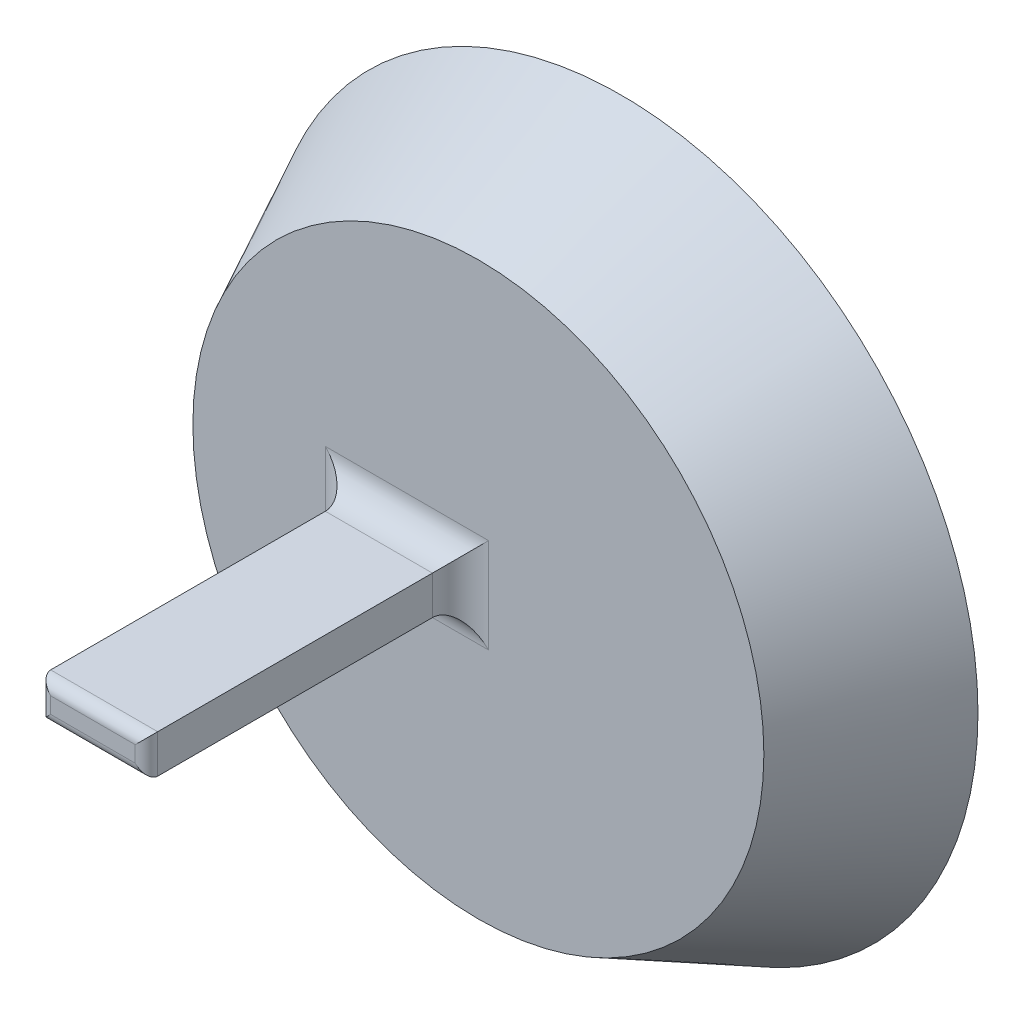
ISO-10303-21;
HEADER;
FILE_DESCRIPTION(('STEP AP214'),'2;1');
FILE_NAME('part.step','',(''),(''),'','','');
FILE_SCHEMA(('AUTOMOTIVE_DESIGN { 1 0 10303 214 1 1 1 1 }'));
ENDSEC;
DATA;
#1=APPLICATION_CONTEXT('core data for automotive mechanical design processes');
#2=APPLICATION_PROTOCOL_DEFINITION('international standard','automotive_design',2000,#1);
#3=PRODUCT_CONTEXT('',#1,'mechanical');
#4=PRODUCT('Part','Part','',(#3));
#5=PRODUCT_RELATED_PRODUCT_CATEGORY('part','',(#4));
#6=PRODUCT_DEFINITION_FORMATION('','',#4);
#7=PRODUCT_DEFINITION_CONTEXT('part definition',#1,'design');
#8=PRODUCT_DEFINITION('design','',#6,#7);
#9=PRODUCT_DEFINITION_SHAPE('','',#8);
#10=(LENGTH_UNIT() NAMED_UNIT(*) SI_UNIT(.MILLI.,.METRE.));
#11=(NAMED_UNIT(*) PLANE_ANGLE_UNIT() SI_UNIT($,.RADIAN.));
#12=(NAMED_UNIT(*) SI_UNIT($,.STERADIAN.) SOLID_ANGLE_UNIT());
#13=UNCERTAINTY_MEASURE_WITH_UNIT(LENGTH_MEASURE(1.E-05),#10,'distance_accuracy_value','');
#14=(GEOMETRIC_REPRESENTATION_CONTEXT(3) GLOBAL_UNCERTAINTY_ASSIGNED_CONTEXT((#13)) GLOBAL_UNIT_ASSIGNED_CONTEXT((#10,
#11,#12)) REPRESENTATION_CONTEXT('',''));
#15=CARTESIAN_POINT('',(0.,0.,0.));
#16=DIRECTION('',(0.,0.,1.));
#17=DIRECTION('',(1.,0.,0.));
#18=AXIS2_PLACEMENT_3D('',#15,#16,#17);
#19=CARTESIAN_POINT('',(0.,0.,25.4));
#20=DIRECTION('',(0.,0.,1.));
#21=DIRECTION('',(1.,0.,0.));
#22=AXIS2_PLACEMENT_3D('',#19,#20,#21);
#23=PLANE('',#22);
#24=DIRECTION('',(1.,0.,0.));
#25=VECTOR('',#24,1.);
#26=CARTESIAN_POINT('',(0.,-8.429,25.4));
#27=LINE('',#26,#25);
#28=CARTESIAN_POINT('',(1.825,-8.429,25.4));
#29=VERTEX_POINT('',#28);
#30=CARTESIAN_POINT('',(-27.225,-8.429,25.4));
#31=VERTEX_POINT('',#30);
#32=EDGE_CURVE('E175',#29,#31,#27,.F.);
#33=ORIENTED_EDGE('',*,*,#32,.T.);
#34=DIRECTION('',(0.,-1.,0.));
#35=VECTOR('',#34,1.);
#36=CARTESIAN_POINT('',(-27.225,0.,25.4));
#37=LINE('',#36,#35);
#38=CARTESIAN_POINT('',(-27.225,8.42899999999999,25.4));
#39=VERTEX_POINT('',#38);
#40=EDGE_CURVE('E184',#31,#39,#37,.F.);
#41=ORIENTED_EDGE('',*,*,#40,.T.);
#42=DIRECTION('',(-1.,0.,0.));
#43=VECTOR('',#42,1.);
#44=CARTESIAN_POINT('',(0.,8.429,25.4));
#45=LINE('',#44,#43);
#46=CARTESIAN_POINT('',(1.825,8.429,25.4));
#47=VERTEX_POINT('',#46);
#48=EDGE_CURVE('E181',#39,#47,#45,.F.);
#49=ORIENTED_EDGE('',*,*,#48,.T.);
#50=DIRECTION('',(0.,1.,0.));
#51=VECTOR('',#50,1.);
#52=CARTESIAN_POINT('',(1.825,0.,25.4));
#53=LINE('',#52,#51);
#54=EDGE_CURVE('E178',#47,#29,#53,.F.);
#55=ORIENTED_EDGE('',*,*,#54,.T.);
#56=EDGE_LOOP('',(#33,#41,#49,#55));
#57=FACE_BOUND('',#56,.T.);
#58=CARTESIAN_POINT('',(0.,0.,25.4));
#59=DIRECTION('',(0.,0.,1.));
#60=DIRECTION('',(1.,0.,0.));
#61=AXIS2_PLACEMENT_3D('',#58,#59,#60);
#62=CIRCLE('',#61,50.8);
#63=CARTESIAN_POINT('',(50.8,0.,25.4));
#64=VERTEX_POINT('',#63);
#65=EDGE_CURVE('E139',#64,#64,#62,.T.);
#66=ORIENTED_EDGE('',*,*,#65,.T.);
#67=EDGE_LOOP('',(#66));
#68=FACE_BOUND('',#67,.T.);
#69=ADVANCED_FACE('F49',(#57,#68),#23,.T.);
#70=CARTESIAN_POINT('',(0.,0.,0.));
#71=DIRECTION('',(0.,0.,1.));
#72=DIRECTION('',(1.,0.,0.));
#73=AXIS2_PLACEMENT_3D('',#70,#71,#72);
#74=PLANE('',#73);
#75=CARTESIAN_POINT('',(0.,0.,0.));
#76=DIRECTION('',(0.,0.,1.));
#77=DIRECTION('',(1.,0.,0.));
#78=AXIS2_PLACEMENT_3D('',#75,#76,#77);
#79=CIRCLE('',#78,52.3196601125011);
#80=CARTESIAN_POINT('',(52.3196601125011,0.,0.));
#81=VERTEX_POINT('',#80);
#82=EDGE_CURVE('E231',#81,#81,#79,.T.);
#83=ORIENTED_EDGE('',*,*,#82,.T.);
#84=EDGE_LOOP('',(#83));
#85=FACE_BOUND('',#84,.T.);
#86=CARTESIAN_POINT('',(0.,0.,0.));
#87=DIRECTION('',(0.,0.,1.));
#88=DIRECTION('',(1.,0.,0.));
#89=AXIS2_PLACEMENT_3D('',#86,#87,#88);
#90=CIRCLE('',#89,63.5);
#91=CARTESIAN_POINT('',(63.5,0.,0.));
#92=VERTEX_POINT('',#91);
#93=EDGE_CURVE('E245',#92,#92,#90,.T.);
#94=ORIENTED_EDGE('',*,*,#93,.F.);
#95=EDGE_LOOP('',(#94));
#96=FACE_BOUND('',#95,.T.);
#97=ADVANCED_FACE('F268',(#85,#96),#74,.F.);
#98=CARTESIAN_POINT('',(0.,0.,25.4));
#99=DIRECTION('',(0.,0.,-1.));
#100=DIRECTION('',(-1.,0.,0.));
#101=AXIS2_PLACEMENT_3D('',#98,#99,#100);
#102=CONICAL_SURFACE('',#101,50.8,0.463647609000807);
#103=ORIENTED_EDGE('',*,*,#93,.T.);
#104=EDGE_LOOP('',(#103));
#105=FACE_BOUND('',#104,.T.);
#106=ORIENTED_EDGE('',*,*,#65,.F.);
#107=EDGE_LOOP('',(#106));
#108=FACE_BOUND('',#107,.T.);
#109=ADVANCED_FACE('F257',(#105,#108),#102,.T.);
#110=CARTESIAN_POINT('',(0.,0.,15.4));
#111=DIRECTION('',(0.,0.,1.));
#112=DIRECTION('',(1.,0.,0.));
#113=AXIS2_PLACEMENT_3D('',#110,#111,#112);
#114=PLANE('',#113);
#115=CARTESIAN_POINT('',(0.,0.,15.4));
#116=DIRECTION('',(0.,0.,1.));
#117=DIRECTION('',(1.,0.,0.));
#118=AXIS2_PLACEMENT_3D('',#115,#116,#117);
#119=CIRCLE('',#118,44.6196601125011);
#120=CARTESIAN_POINT('',(44.6196601125011,0.,15.4));
#121=VERTEX_POINT('',#120);
#122=EDGE_CURVE('E237',#121,#121,#119,.T.);
#123=ORIENTED_EDGE('',*,*,#122,.F.);
#124=EDGE_LOOP('',(#123));
#125=FACE_BOUND('',#124,.T.);
#126=ADVANCED_FACE('F267',(#125),#114,.F.);
#127=CARTESIAN_POINT('',(0.,0.,20.9278640450004));
#128=DIRECTION('',(0.,0.,-1.));
#129=DIRECTION('',(-1.,0.,0.));
#130=AXIS2_PLACEMENT_3D('',#127,#128,#129);
#131=CONICAL_SURFACE('',#130,41.8557280900008,0.463647609000807);
#132=ORIENTED_EDGE('',*,*,#82,.F.);
#133=EDGE_LOOP('',(#132));
#134=FACE_BOUND('',#133,.T.);
#135=ORIENTED_EDGE('',*,*,#122,.T.);
#136=EDGE_LOOP('',(#135));
#137=FACE_BOUND('',#136,.T.);
#138=ADVANCED_FACE('F342',(#134,#137),#131,.F.);
#139=CARTESIAN_POINT('',(-22.225,-3.429,81.28));
#140=DIRECTION('',(1.,0.,0.));
#141=DIRECTION('',(0.,0.,-1.));
#142=AXIS2_PLACEMENT_3D('',#139,#140,#141);
#143=PLANE('',#142);
#144=DIRECTION('',(0.,0.,-1.));
#145=VECTOR('',#144,1.);
#146=CARTESIAN_POINT('',(-22.225,3.429,81.28));
#147=LINE('',#146,#145);
#148=CARTESIAN_POINT('',(-22.225,3.429,79.28));
#149=VERTEX_POINT('',#148);
#150=CARTESIAN_POINT('',(-22.225,3.429,30.4));
#151=VERTEX_POINT('',#150);
#152=EDGE_CURVE('E171',#149,#151,#147,.T.);
#153=ORIENTED_EDGE('',*,*,#152,.T.);
#154=DIRECTION('',(0.,-1.,0.));
#155=VECTOR('',#154,1.);
#156=CARTESIAN_POINT('',(-22.225,-3.429,30.4));
#157=LINE('',#156,#155);
#158=CARTESIAN_POINT('',(-22.225,-3.429,30.4));
#159=VERTEX_POINT('',#158);
#160=EDGE_CURVE('E161',#151,#159,#157,.T.);
#161=ORIENTED_EDGE('',*,*,#160,.T.);
#162=DIRECTION('',(0.,0.,-1.));
#163=VECTOR('',#162,1.);
#164=CARTESIAN_POINT('',(-22.225,-3.429,81.28));
#165=LINE('',#164,#163);
#166=CARTESIAN_POINT('',(-22.225,-3.429,79.28));
#167=VERTEX_POINT('',#166);
#168=EDGE_CURVE('E226',#167,#159,#165,.T.);
#169=ORIENTED_EDGE('',*,*,#168,.F.);
#170=DIRECTION('',(0.,-1.,0.));
#171=VECTOR('',#170,1.);
#172=CARTESIAN_POINT('',(-22.225,3.429,79.28));
#173=LINE('',#172,#171);
#174=EDGE_CURVE('E159',#167,#149,#173,.F.);
#175=ORIENTED_EDGE('',*,*,#174,.T.);
#176=EDGE_LOOP('',(#153,#161,#169,#175));
#177=FACE_BOUND('',#176,.T.);
#178=ADVANCED_FACE('F225',(#177),#143,.F.);
#179=CARTESIAN_POINT('',(-3.175,-3.429,81.28));
#180=DIRECTION('',(0.,1.,0.));
#181=DIRECTION('',(-1.,0.,0.));
#182=AXIS2_PLACEMENT_3D('',#179,#180,#181);
#183=PLANE('',#182);
#184=ORIENTED_EDGE('',*,*,#168,.T.);
#185=DIRECTION('',(1.,0.,0.));
#186=VECTOR('',#185,1.);
#187=CARTESIAN_POINT('',(-3.175,-3.429,30.4));
#188=LINE('',#187,#186);
#189=CARTESIAN_POINT('',(-3.175,-3.429,30.4));
#190=VERTEX_POINT('',#189);
#191=EDGE_CURVE('E12',#159,#190,#188,.T.);
#192=ORIENTED_EDGE('',*,*,#191,.T.);
#193=DIRECTION('',(0.,0.,-1.));
#194=VECTOR('',#193,1.);
#195=CARTESIAN_POINT('',(-3.175,-3.429,81.28));
#196=LINE('',#195,#194);
#197=CARTESIAN_POINT('',(-3.175,-3.429,79.28));
#198=VERTEX_POINT('',#197);
#199=EDGE_CURVE('E232',#198,#190,#196,.T.);
#200=ORIENTED_EDGE('',*,*,#199,.F.);
#201=DIRECTION('',(1.,0.,0.));
#202=VECTOR('',#201,1.);
#203=CARTESIAN_POINT('',(-22.225,-3.429,79.28));
#204=LINE('',#203,#202);
#205=EDGE_CURVE('E156',#198,#167,#204,.F.);
#206=ORIENTED_EDGE('',*,*,#205,.T.);
#207=EDGE_LOOP('',(#184,#192,#200,#206));
#208=FACE_BOUND('',#207,.T.);
#209=ADVANCED_FACE('F228',(#208),#183,.F.);
#210=CARTESIAN_POINT('',(-3.175,-3.429,81.28));
#211=DIRECTION('',(-1.,0.,0.));
#212=DIRECTION('',(0.,0.,1.));
#213=AXIS2_PLACEMENT_3D('',#210,#211,#212);
#214=PLANE('',#213);
#215=ORIENTED_EDGE('',*,*,#199,.T.);
#216=DIRECTION('',(0.,1.,0.));
#217=VECTOR('',#216,1.);
#218=CARTESIAN_POINT('',(-3.175,-3.429,30.4));
#219=LINE('',#218,#217);
#220=CARTESIAN_POINT('',(-3.175,3.429,30.4));
#221=VERTEX_POINT('',#220);
#222=EDGE_CURVE('E59',#190,#221,#219,.T.);
#223=ORIENTED_EDGE('',*,*,#222,.T.);
#224=DIRECTION('',(0.,0.,-1.));
#225=VECTOR('',#224,1.);
#226=CARTESIAN_POINT('',(-3.175,3.429,81.28));
#227=LINE('',#226,#225);
#228=CARTESIAN_POINT('',(-3.175,3.429,79.28));
#229=VERTEX_POINT('',#228);
#230=EDGE_CURVE('E239',#229,#221,#227,.T.);
#231=ORIENTED_EDGE('',*,*,#230,.F.);
#232=DIRECTION('',(0.,1.,0.));
#233=VECTOR('',#232,1.);
#234=CARTESIAN_POINT('',(-3.175,-3.429,79.28));
#235=LINE('',#234,#233);
#236=EDGE_CURVE('E149',#229,#198,#235,.F.);
#237=ORIENTED_EDGE('',*,*,#236,.T.);
#238=EDGE_LOOP('',(#215,#223,#231,#237));
#239=FACE_BOUND('',#238,.T.);
#240=ADVANCED_FACE('F318',(#239),#214,.F.);
#241=CARTESIAN_POINT('',(-3.175,3.429,81.28));
#242=DIRECTION('',(0.,-1.,0.));
#243=DIRECTION('',(1.,0.,0.));
#244=AXIS2_PLACEMENT_3D('',#241,#242,#243);
#245=PLANE('',#244);
#246=ORIENTED_EDGE('',*,*,#230,.T.);
#247=DIRECTION('',(-1.,0.,0.));
#248=VECTOR('',#247,1.);
#249=CARTESIAN_POINT('',(-3.175,3.429,30.4));
#250=LINE('',#249,#248);
#251=EDGE_CURVE('E188',#221,#151,#250,.T.);
#252=ORIENTED_EDGE('',*,*,#251,.T.);
#253=ORIENTED_EDGE('',*,*,#152,.F.);
#254=DIRECTION('',(-1.,0.,0.));
#255=VECTOR('',#254,1.);
#256=CARTESIAN_POINT('',(-3.175,3.429,79.28));
#257=LINE('',#256,#255);
#258=EDGE_CURVE('E124',#149,#229,#257,.F.);
#259=ORIENTED_EDGE('',*,*,#258,.T.);
#260=EDGE_LOOP('',(#246,#252,#253,#259));
#261=FACE_BOUND('',#260,.T.);
#262=ADVANCED_FACE('F317',(#261),#245,.F.);
#263=CARTESIAN_POINT('',(0.,0.,81.28));
#264=DIRECTION('',(0.,0.,1.));
#265=DIRECTION('',(1.,0.,0.));
#266=AXIS2_PLACEMENT_3D('',#263,#264,#265);
#267=PLANE('',#266);
#268=DIRECTION('',(0.,1.,0.));
#269=VECTOR('',#268,1.);
#270=CARTESIAN_POINT('',(-5.175,3.429,81.28));
#271=LINE('',#270,#269);
#272=CARTESIAN_POINT('',(-5.175,-1.429,81.28));
#273=VERTEX_POINT('',#272);
#274=CARTESIAN_POINT('',(-5.175,1.429,81.28));
#275=VERTEX_POINT('',#274);
#276=EDGE_CURVE('E143',#273,#275,#271,.T.);
#277=ORIENTED_EDGE('',*,*,#276,.T.);
#278=DIRECTION('',(-1.,0.,0.));
#279=VECTOR('',#278,1.);
#280=CARTESIAN_POINT('',(-22.225,1.429,81.28));
#281=LINE('',#280,#279);
#282=CARTESIAN_POINT('',(-20.225,1.429,81.28));
#283=VERTEX_POINT('',#282);
#284=EDGE_CURVE('E122',#275,#283,#281,.T.);
#285=ORIENTED_EDGE('',*,*,#284,.T.);
#286=DIRECTION('',(0.,-1.,0.));
#287=VECTOR('',#286,1.);
#288=CARTESIAN_POINT('',(-20.225,-3.429,81.28));
#289=LINE('',#288,#287);
#290=CARTESIAN_POINT('',(-20.225,-1.429,81.28));
#291=VERTEX_POINT('',#290);
#292=EDGE_CURVE('E131',#283,#291,#289,.T.);
#293=ORIENTED_EDGE('',*,*,#292,.T.);
#294=DIRECTION('',(1.,0.,0.));
#295=VECTOR('',#294,1.);
#296=CARTESIAN_POINT('',(-3.175,-1.429,81.28));
#297=LINE('',#296,#295);
#298=EDGE_CURVE('E138',#291,#273,#297,.T.);
#299=ORIENTED_EDGE('',*,*,#298,.T.);
#300=EDGE_LOOP('',(#277,#285,#293,#299));
#301=FACE_BOUND('',#300,.T.);
#302=ADVANCED_FACE('F141',(#301),#267,.T.);
#303=CARTESIAN_POINT('',(0.,-1.429,79.28));
#304=DIRECTION('',(-1.,0.,0.));
#305=DIRECTION('',(0.,-1.,0.));
#306=AXIS2_PLACEMENT_3D('',#303,#304,#305);
#307=CYLINDRICAL_SURFACE('',#306,2.);
#308=CARTESIAN_POINT('',(-20.225,-1.429,79.28));
#309=DIRECTION('',(-0.707106781186548,0.707106781186547,0.));
#310=DIRECTION('',(0.707106781186547,0.707106781186548,0.));
#311=AXIS2_PLACEMENT_3D('',#308,#309,#310);
#312=ELLIPSE('',#311,2.82842712474619,2.);
#313=EDGE_CURVE('E134',#167,#291,#312,.T.);
#314=ORIENTED_EDGE('',*,*,#313,.F.);
#315=ORIENTED_EDGE('',*,*,#205,.F.);
#316=CARTESIAN_POINT('',(-5.175,-1.429,79.28));
#317=DIRECTION('',(-0.707106781186547,-0.707106781186548,0.));
#318=DIRECTION('',(-0.707106781186548,0.707106781186547,0.));
#319=AXIS2_PLACEMENT_3D('',#316,#317,#318);
#320=ELLIPSE('',#319,2.82842712474619,2.);
#321=EDGE_CURVE('E167',#273,#198,#320,.F.);
#322=ORIENTED_EDGE('',*,*,#321,.F.);
#323=ORIENTED_EDGE('',*,*,#298,.F.);
#324=EDGE_LOOP('',(#314,#315,#322,#323));
#325=FACE_BOUND('',#324,.T.);
#326=ADVANCED_FACE('F312',(#325),#307,.T.);
#327=CARTESIAN_POINT('',(-5.175,0.,79.28));
#328=DIRECTION('',(0.,-1.,0.));
#329=DIRECTION('',(0.,0.,-1.));
#330=AXIS2_PLACEMENT_3D('',#327,#328,#329);
#331=CYLINDRICAL_SURFACE('',#330,2.);
#332=ORIENTED_EDGE('',*,*,#321,.T.);
#333=ORIENTED_EDGE('',*,*,#236,.F.);
#334=CARTESIAN_POINT('',(-5.175,1.429,79.28));
#335=DIRECTION('',(0.707106781186548,-0.707106781186547,0.));
#336=DIRECTION('',(-0.707106781186547,-0.707106781186548,0.));
#337=AXIS2_PLACEMENT_3D('',#334,#335,#336);
#338=ELLIPSE('',#337,2.82842712474619,2.);
#339=EDGE_CURVE('E128',#275,#229,#338,.F.);
#340=ORIENTED_EDGE('',*,*,#339,.F.);
#341=ORIENTED_EDGE('',*,*,#276,.F.);
#342=EDGE_LOOP('',(#332,#333,#340,#341));
#343=FACE_BOUND('',#342,.T.);
#344=ADVANCED_FACE('F315',(#343),#331,.T.);
#345=CARTESIAN_POINT('',(-20.225,0.,79.28));
#346=DIRECTION('',(0.,1.,0.));
#347=DIRECTION('',(0.,0.,1.));
#348=AXIS2_PLACEMENT_3D('',#345,#346,#347);
#349=CYLINDRICAL_SURFACE('',#348,2.);
#350=ORIENTED_EDGE('',*,*,#313,.T.);
#351=ORIENTED_EDGE('',*,*,#292,.F.);
#352=CARTESIAN_POINT('',(-20.225,1.429,79.28));
#353=DIRECTION('',(0.707106781186547,0.707106781186548,0.));
#354=DIRECTION('',(-0.707106781186548,0.707106781186547,0.));
#355=AXIS2_PLACEMENT_3D('',#352,#353,#354);
#356=ELLIPSE('',#355,2.82842712474619,2.);
#357=EDGE_CURVE('E118',#149,#283,#356,.T.);
#358=ORIENTED_EDGE('',*,*,#357,.F.);
#359=ORIENTED_EDGE('',*,*,#174,.F.);
#360=EDGE_LOOP('',(#350,#351,#358,#359));
#361=FACE_BOUND('',#360,.T.);
#362=ADVANCED_FACE('F132',(#361),#349,.T.);
#363=CARTESIAN_POINT('',(0.,1.429,79.28));
#364=DIRECTION('',(1.,0.,0.));
#365=DIRECTION('',(0.,1.,0.));
#366=AXIS2_PLACEMENT_3D('',#363,#364,#365);
#367=CYLINDRICAL_SURFACE('',#366,2.);
#368=ORIENTED_EDGE('',*,*,#339,.T.);
#369=ORIENTED_EDGE('',*,*,#258,.F.);
#370=ORIENTED_EDGE('',*,*,#357,.T.);
#371=ORIENTED_EDGE('',*,*,#284,.F.);
#372=EDGE_LOOP('',(#368,#369,#370,#371));
#373=FACE_BOUND('',#372,.T.);
#374=ADVANCED_FACE('F120',(#373),#367,.T.);
#375=CARTESIAN_POINT('',(1.825,-3.429,30.4));
#376=DIRECTION('',(0.,1.,0.));
#377=DIRECTION('',(0.,0.,1.));
#378=AXIS2_PLACEMENT_3D('',#375,#376,#377);
#379=CYLINDRICAL_SURFACE('',#378,5.);
#380=CARTESIAN_POINT('',(1.825,-8.429,30.4));
#381=DIRECTION('',(0.707106781186547,0.707106781186548,0.));
#382=DIRECTION('',(0.707106781186548,-0.707106781186547,0.));
#383=AXIS2_PLACEMENT_3D('',#380,#381,#382);
#384=ELLIPSE('',#383,7.07106781186547,5.);
#385=EDGE_CURVE('E198',#29,#190,#384,.T.);
#386=ORIENTED_EDGE('',*,*,#385,.F.);
#387=ORIENTED_EDGE('',*,*,#54,.F.);
#388=CARTESIAN_POINT('',(1.825,8.429,30.4));
#389=DIRECTION('',(-0.707106781186548,0.707106781186547,0.));
#390=DIRECTION('',(0.707106781186547,0.707106781186548,0.));
#391=AXIS2_PLACEMENT_3D('',#388,#389,#390);
#392=ELLIPSE('',#391,7.07106781186548,5.);
#393=EDGE_CURVE('E53',#221,#47,#392,.F.);
#394=ORIENTED_EDGE('',*,*,#393,.F.);
#395=ORIENTED_EDGE('',*,*,#222,.F.);
#396=EDGE_LOOP('',(#386,#387,#394,#395));
#397=FACE_BOUND('',#396,.T.);
#398=ADVANCED_FACE('F51',(#397),#379,.F.);
#399=CARTESIAN_POINT('',(-3.175,8.429,30.4));
#400=DIRECTION('',(-1.,0.,0.));
#401=DIRECTION('',(0.,-1.,0.));
#402=AXIS2_PLACEMENT_3D('',#399,#400,#401);
#403=CYLINDRICAL_SURFACE('',#402,5.);
#404=ORIENTED_EDGE('',*,*,#393,.T.);
#405=ORIENTED_EDGE('',*,*,#48,.F.);
#406=CARTESIAN_POINT('',(-27.225,8.42899999999999,30.4));
#407=DIRECTION('',(-0.707106781186547,-0.707106781186548,0.));
#408=DIRECTION('',(-0.707106781186548,0.707106781186547,0.));
#409=AXIS2_PLACEMENT_3D('',#406,#407,#408);
#410=ELLIPSE('',#409,7.07106781186547,5.);
#411=EDGE_CURVE('E196',#151,#39,#410,.F.);
#412=ORIENTED_EDGE('',*,*,#411,.F.);
#413=ORIENTED_EDGE('',*,*,#251,.F.);
#414=EDGE_LOOP('',(#404,#405,#412,#413));
#415=FACE_BOUND('',#414,.T.);
#416=ADVANCED_FACE('F210',(#415),#403,.F.);
#417=CARTESIAN_POINT('',(-3.175,-8.429,30.4));
#418=DIRECTION('',(1.,0.,0.));
#419=DIRECTION('',(0.,1.,0.));
#420=AXIS2_PLACEMENT_3D('',#417,#418,#419);
#421=CYLINDRICAL_SURFACE('',#420,5.);
#422=ORIENTED_EDGE('',*,*,#385,.T.);
#423=ORIENTED_EDGE('',*,*,#191,.F.);
#424=CARTESIAN_POINT('',(-27.225,-8.429,30.4));
#425=DIRECTION('',(0.707106781186548,-0.707106781186547,0.));
#426=DIRECTION('',(0.707106781186547,0.707106781186548,0.));
#427=AXIS2_PLACEMENT_3D('',#424,#425,#426);
#428=ELLIPSE('',#427,7.07106781186548,5.);
#429=EDGE_CURVE('E193',#31,#159,#428,.T.);
#430=ORIENTED_EDGE('',*,*,#429,.F.);
#431=ORIENTED_EDGE('',*,*,#32,.F.);
#432=EDGE_LOOP('',(#422,#423,#430,#431));
#433=FACE_BOUND('',#432,.T.);
#434=ADVANCED_FACE('F221',(#433),#421,.F.);
#435=CARTESIAN_POINT('',(-27.225,-3.429,30.4));
#436=DIRECTION('',(0.,-1.,0.));
#437=DIRECTION('',(0.,0.,-1.));
#438=AXIS2_PLACEMENT_3D('',#435,#436,#437);
#439=CYLINDRICAL_SURFACE('',#438,5.);
#440=ORIENTED_EDGE('',*,*,#411,.T.);
#441=ORIENTED_EDGE('',*,*,#40,.F.);
#442=ORIENTED_EDGE('',*,*,#429,.T.);
#443=ORIENTED_EDGE('',*,*,#160,.F.);
#444=EDGE_LOOP('',(#440,#441,#442,#443));
#445=FACE_BOUND('',#444,.T.);
#446=ADVANCED_FACE('F219',(#445),#439,.F.);
#447=CLOSED_SHELL('',(#69,#97,#109,#126,#138,#178,#209,#240,#262,#302,#326,#344,#362,#374,#398,
#416,#434,#446));
#448=MANIFOLD_SOLID_BREP('B2',#447);
#449=ADVANCED_BREP_SHAPE_REPRESENTATION('',(#18,#448),#14);
#450=SHAPE_DEFINITION_REPRESENTATION(#9,#449);
ENDSEC;
END-ISO-10303-21;
